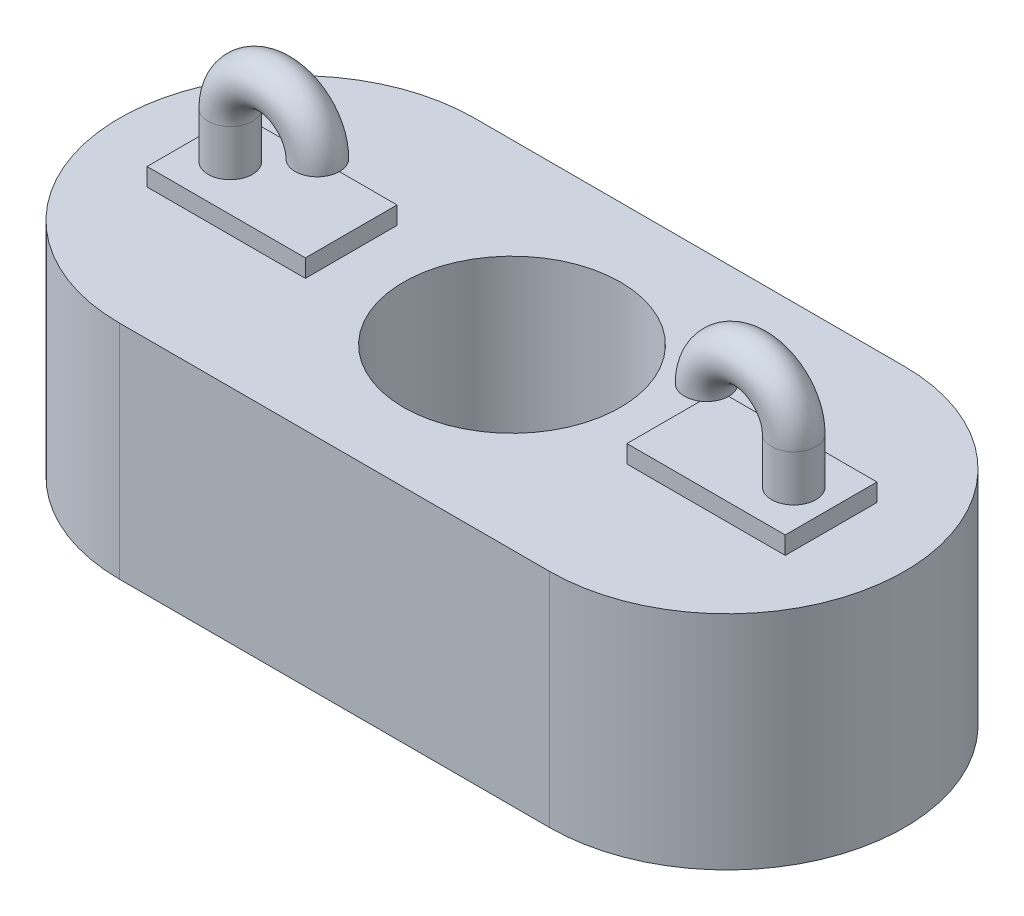
ISO-10303-21;
HEADER;
FILE_DESCRIPTION(('STEP AP214'),'2;1');
FILE_NAME('part.step','',(''),(''),'','','');
FILE_SCHEMA(('AUTOMOTIVE_DESIGN { 1 0 10303 214 1 1 1 1 }'));
ENDSEC;
DATA;
#1=APPLICATION_CONTEXT('core data for automotive mechanical design processes');
#2=APPLICATION_PROTOCOL_DEFINITION('international standard','automotive_design',2000,#1);
#3=PRODUCT_CONTEXT('',#1,'mechanical');
#4=PRODUCT('Part','Part','',(#3));
#5=PRODUCT_RELATED_PRODUCT_CATEGORY('part','',(#4));
#6=PRODUCT_DEFINITION_FORMATION('','',#4);
#7=PRODUCT_DEFINITION_CONTEXT('part definition',#1,'design');
#8=PRODUCT_DEFINITION('design','',#6,#7);
#9=PRODUCT_DEFINITION_SHAPE('','',#8);
#10=(LENGTH_UNIT() NAMED_UNIT(*) SI_UNIT(.MILLI.,.METRE.));
#11=(NAMED_UNIT(*) PLANE_ANGLE_UNIT() SI_UNIT($,.RADIAN.));
#12=(NAMED_UNIT(*) SI_UNIT($,.STERADIAN.) SOLID_ANGLE_UNIT());
#13=UNCERTAINTY_MEASURE_WITH_UNIT(LENGTH_MEASURE(1.E-05),#10,'distance_accuracy_value','');
#14=(GEOMETRIC_REPRESENTATION_CONTEXT(3) GLOBAL_UNCERTAINTY_ASSIGNED_CONTEXT((#13)) GLOBAL_UNIT_ASSIGNED_CONTEXT((#10,
#11,#12)) REPRESENTATION_CONTEXT('',''));
#15=CARTESIAN_POINT('',(0.,0.,0.));
#16=DIRECTION('',(0.,0.,1.));
#17=DIRECTION('',(1.,0.,0.));
#18=AXIS2_PLACEMENT_3D('',#15,#16,#17);
#19=CARTESIAN_POINT('',(4.8461150720265,5.,0.));
#20=DIRECTION('',(0.,-1.,0.));
#21=DIRECTION('',(0.,0.,-1.));
#22=AXIS2_PLACEMENT_3D('',#19,#20,#21);
#23=PLANE('',#22);
#24=DIRECTION('',(-1.,0.,0.));
#25=VECTOR('',#24,1.);
#26=CARTESIAN_POINT('',(7.19067537341715,5.,1.03330571310918));
#27=LINE('',#26,#25);
#28=CARTESIAN_POINT('',(7.19067537341715,5.,1.03330571310918));
#29=VERTEX_POINT('',#28);
#30=CARTESIAN_POINT('',(3.62364743227321,5.,1.03330571310918));
#31=VERTEX_POINT('',#30);
#32=EDGE_CURVE('E159',#29,#31,#27,.T.);
#33=ORIENTED_EDGE('',*,*,#32,.T.);
#34=DIRECTION('',(0.,0.,-1.));
#35=VECTOR('',#34,1.);
#36=CARTESIAN_POINT('',(3.62364743227321,5.,1.03330571310918));
#37=LINE('',#36,#35);
#38=CARTESIAN_POINT('',(3.62364743227321,5.,-1.03330571310918));
#39=VERTEX_POINT('',#38);
#40=EDGE_CURVE('E155',#31,#39,#37,.T.);
#41=ORIENTED_EDGE('',*,*,#40,.T.);
#42=DIRECTION('',(1.,0.,0.));
#43=VECTOR('',#42,1.);
#44=CARTESIAN_POINT('',(7.19067537341715,5.,-1.03330571310918));
#45=LINE('',#44,#43);
#46=CARTESIAN_POINT('',(7.19067537341715,5.,-1.03330571310918));
#47=VERTEX_POINT('',#46);
#48=EDGE_CURVE('E168',#39,#47,#45,.T.);
#49=ORIENTED_EDGE('',*,*,#48,.T.);
#50=DIRECTION('',(0.,0.,1.));
#51=VECTOR('',#50,1.);
#52=CARTESIAN_POINT('',(7.19067537341715,5.,1.03330571310918));
#53=LINE('',#52,#51);
#54=EDGE_CURVE('E72',#47,#29,#53,.T.);
#55=ORIENTED_EDGE('',*,*,#54,.T.);
#56=EDGE_LOOP('',(#33,#41,#49,#55));
#57=FACE_BOUND('',#56,.T.);
#58=CARTESIAN_POINT('',(0.,5.,0.));
#59=DIRECTION('',(0.,1.,0.));
#60=DIRECTION('',(0.,0.,1.));
#61=AXIS2_PLACEMENT_3D('',#58,#59,#60);
#62=CIRCLE('',#61,2.44543136988168);
#63=CARTESIAN_POINT('',(0.,5.,2.44543136988168));
#64=VERTEX_POINT('',#63);
#65=EDGE_CURVE('E226',#64,#64,#62,.T.);
#66=ORIENTED_EDGE('',*,*,#65,.F.);
#67=EDGE_LOOP('',(#66));
#68=FACE_BOUND('',#67,.T.);
#69=CARTESIAN_POINT('',(4.8461150720265,5.,0.));
#70=DIRECTION('',(0.,1.,0.));
#71=DIRECTION('',(0.,0.,-1.));
#72=AXIS2_PLACEMENT_3D('',#69,#70,#71);
#73=CIRCLE('',#72,4.);
#74=CARTESIAN_POINT('',(4.8461150720265,5.,4.));
#75=VERTEX_POINT('',#74);
#76=CARTESIAN_POINT('',(4.8461150720265,5.,-4.));
#77=VERTEX_POINT('',#76);
#78=EDGE_CURVE('E232',#75,#77,#73,.T.);
#79=ORIENTED_EDGE('',*,*,#78,.T.);
#80=DIRECTION('',(-1.,0.,0.));
#81=VECTOR('',#80,1.);
#82=CARTESIAN_POINT('',(-4.8461150720265,5.,-4.));
#83=LINE('',#82,#81);
#84=CARTESIAN_POINT('',(-4.8461150720265,5.,-4.));
#85=VERTEX_POINT('',#84);
#86=EDGE_CURVE('E235',#77,#85,#83,.T.);
#87=ORIENTED_EDGE('',*,*,#86,.T.);
#88=CARTESIAN_POINT('',(-4.8461150720265,5.,0.));
#89=DIRECTION('',(0.,1.,0.));
#90=DIRECTION('',(0.,0.,1.));
#91=AXIS2_PLACEMENT_3D('',#88,#89,#90);
#92=CIRCLE('',#91,4.);
#93=CARTESIAN_POINT('',(-4.8461150720265,5.,4.));
#94=VERTEX_POINT('',#93);
#95=EDGE_CURVE('E238',#85,#94,#92,.T.);
#96=ORIENTED_EDGE('',*,*,#95,.T.);
#97=DIRECTION('',(1.,0.,0.));
#98=VECTOR('',#97,1.);
#99=CARTESIAN_POINT('',(-4.8461150720265,5.,4.));
#100=LINE('',#99,#98);
#101=EDGE_CURVE('E240',#94,#75,#100,.T.);
#102=ORIENTED_EDGE('',*,*,#101,.T.);
#103=EDGE_LOOP('',(#79,#87,#96,#102));
#104=FACE_BOUND('',#103,.T.);
#105=DIRECTION('',(0.,0.,-1.));
#106=VECTOR('',#105,1.);
#107=CARTESIAN_POINT('',(-3.62364743227321,5.,1.03330571310918));
#108=LINE('',#107,#106);
#109=CARTESIAN_POINT('',(-3.62364743227321,5.,1.03330571310918));
#110=VERTEX_POINT('',#109);
#111=CARTESIAN_POINT('',(-3.62364743227321,5.,-1.03330571310918));
#112=VERTEX_POINT('',#111);
#113=EDGE_CURVE('E195',#110,#112,#108,.T.);
#114=ORIENTED_EDGE('',*,*,#113,.F.);
#115=DIRECTION('',(1.,0.,0.));
#116=VECTOR('',#115,1.);
#117=CARTESIAN_POINT('',(-7.19067537341715,5.,1.03330571310918));
#118=LINE('',#117,#116);
#119=CARTESIAN_POINT('',(-7.19067537341715,5.,1.03330571310918));
#120=VERTEX_POINT('',#119);
#121=EDGE_CURVE('E200',#120,#110,#118,.T.);
#122=ORIENTED_EDGE('',*,*,#121,.F.);
#123=DIRECTION('',(0.,0.,1.));
#124=VECTOR('',#123,1.);
#125=CARTESIAN_POINT('',(-7.19067537341715,5.,1.03330571310918));
#126=LINE('',#125,#124);
#127=CARTESIAN_POINT('',(-7.19067537341715,5.,-1.03330571310918));
#128=VERTEX_POINT('',#127);
#129=EDGE_CURVE('E210',#128,#120,#126,.T.);
#130=ORIENTED_EDGE('',*,*,#129,.F.);
#131=DIRECTION('',(-1.,0.,0.));
#132=VECTOR('',#131,1.);
#133=CARTESIAN_POINT('',(-7.19067537341715,5.,-1.03330571310918));
#134=LINE('',#133,#132);
#135=EDGE_CURVE('E80',#112,#128,#134,.T.);
#136=ORIENTED_EDGE('',*,*,#135,.F.);
#137=EDGE_LOOP('',(#114,#122,#130,#136));
#138=FACE_BOUND('',#137,.T.);
#139=ADVANCED_FACE('F57',(#57,#68,#104,#138),#23,.F.);
#140=CARTESIAN_POINT('',(4.8461150720265,0.,0.));
#141=DIRECTION('',(0.,-1.,0.));
#142=DIRECTION('',(0.,0.,-1.));
#143=AXIS2_PLACEMENT_3D('',#140,#141,#142);
#144=PLANE('',#143);
#145=CARTESIAN_POINT('',(4.8461150720265,0.,0.));
#146=DIRECTION('',(0.,1.,0.));
#147=DIRECTION('',(0.,0.,-1.));
#148=AXIS2_PLACEMENT_3D('',#145,#146,#147);
#149=CIRCLE('',#148,4.);
#150=CARTESIAN_POINT('',(4.8461150720265,0.,4.));
#151=VERTEX_POINT('',#150);
#152=CARTESIAN_POINT('',(4.8461150720265,0.,-4.));
#153=VERTEX_POINT('',#152);
#154=EDGE_CURVE('E229',#151,#153,#149,.T.);
#155=ORIENTED_EDGE('',*,*,#154,.F.);
#156=DIRECTION('',(1.,0.,0.));
#157=VECTOR('',#156,1.);
#158=CARTESIAN_POINT('',(-4.8461150720265,0.,4.));
#159=LINE('',#158,#157);
#160=CARTESIAN_POINT('',(-4.8461150720265,0.,4.));
#161=VERTEX_POINT('',#160);
#162=EDGE_CURVE('E236',#161,#151,#159,.T.);
#163=ORIENTED_EDGE('',*,*,#162,.F.);
#164=CARTESIAN_POINT('',(-4.8461150720265,0.,0.));
#165=DIRECTION('',(0.,1.,0.));
#166=DIRECTION('',(0.,0.,1.));
#167=AXIS2_PLACEMENT_3D('',#164,#165,#166);
#168=CIRCLE('',#167,4.);
#169=CARTESIAN_POINT('',(-4.8461150720265,0.,-4.));
#170=VERTEX_POINT('',#169);
#171=EDGE_CURVE('E247',#170,#161,#168,.T.);
#172=ORIENTED_EDGE('',*,*,#171,.F.);
#173=DIRECTION('',(-1.,0.,0.));
#174=VECTOR('',#173,1.);
#175=CARTESIAN_POINT('',(-4.8461150720265,0.,-4.));
#176=LINE('',#175,#174);
#177=EDGE_CURVE('E245',#153,#170,#176,.T.);
#178=ORIENTED_EDGE('',*,*,#177,.F.);
#179=EDGE_LOOP('',(#155,#163,#172,#178));
#180=FACE_BOUND('',#179,.T.);
#181=CARTESIAN_POINT('',(0.,0.,0.));
#182=DIRECTION('',(0.,1.,0.));
#183=DIRECTION('',(0.,0.,1.));
#184=AXIS2_PLACEMENT_3D('',#181,#182,#183);
#185=CIRCLE('',#184,2.44543136988168);
#186=CARTESIAN_POINT('',(0.,0.,2.44543136988168));
#187=VERTEX_POINT('',#186);
#188=EDGE_CURVE('E225',#187,#187,#185,.T.);
#189=ORIENTED_EDGE('',*,*,#188,.T.);
#190=EDGE_LOOP('',(#189));
#191=FACE_BOUND('',#190,.T.);
#192=ADVANCED_FACE('F287',(#180,#191),#144,.T.);
#193=CARTESIAN_POINT('',(4.8461150720265,5.,0.));
#194=DIRECTION('',(0.,-1.,0.));
#195=DIRECTION('',(0.,0.,-1.));
#196=AXIS2_PLACEMENT_3D('',#193,#194,#195);
#197=CYLINDRICAL_SURFACE('',#196,4.);
#198=ORIENTED_EDGE('',*,*,#154,.T.);
#199=DIRECTION('',(0.,-1.,0.));
#200=VECTOR('',#199,1.);
#201=CARTESIAN_POINT('',(4.8461150720265,5.,-4.));
#202=LINE('',#201,#200);
#203=EDGE_CURVE('E258',#77,#153,#202,.T.);
#204=ORIENTED_EDGE('',*,*,#203,.F.);
#205=ORIENTED_EDGE('',*,*,#78,.F.);
#206=DIRECTION('',(0.,-1.,0.));
#207=VECTOR('',#206,1.);
#208=CARTESIAN_POINT('',(4.8461150720265,5.,4.));
#209=LINE('',#208,#207);
#210=EDGE_CURVE('E242',#75,#151,#209,.T.);
#211=ORIENTED_EDGE('',*,*,#210,.T.);
#212=EDGE_LOOP('',(#198,#204,#205,#211));
#213=FACE_BOUND('',#212,.T.);
#214=ADVANCED_FACE('F59',(#213),#197,.T.);
#215=CARTESIAN_POINT('',(-4.8461150720265,5.,-4.));
#216=DIRECTION('',(0.,0.,1.));
#217=DIRECTION('',(1.,0.,0.));
#218=AXIS2_PLACEMENT_3D('',#215,#216,#217);
#219=PLANE('',#218);
#220=ORIENTED_EDGE('',*,*,#177,.T.);
#221=DIRECTION('',(0.,-1.,0.));
#222=VECTOR('',#221,1.);
#223=CARTESIAN_POINT('',(-4.8461150720265,5.,-4.));
#224=LINE('',#223,#222);
#225=EDGE_CURVE('E255',#85,#170,#224,.T.);
#226=ORIENTED_EDGE('',*,*,#225,.F.);
#227=ORIENTED_EDGE('',*,*,#86,.F.);
#228=ORIENTED_EDGE('',*,*,#203,.T.);
#229=EDGE_LOOP('',(#220,#226,#227,#228));
#230=FACE_BOUND('',#229,.T.);
#231=ADVANCED_FACE('F306',(#230),#219,.F.);
#232=CARTESIAN_POINT('',(-4.8461150720265,5.,0.));
#233=DIRECTION('',(0.,-1.,0.));
#234=DIRECTION('',(0.,0.,-1.));
#235=AXIS2_PLACEMENT_3D('',#232,#233,#234);
#236=CYLINDRICAL_SURFACE('',#235,4.);
#237=ORIENTED_EDGE('',*,*,#171,.T.);
#238=DIRECTION('',(0.,-1.,0.));
#239=VECTOR('',#238,1.);
#240=CARTESIAN_POINT('',(-4.8461150720265,5.,4.));
#241=LINE('',#240,#239);
#242=EDGE_CURVE('E252',#94,#161,#241,.T.);
#243=ORIENTED_EDGE('',*,*,#242,.F.);
#244=ORIENTED_EDGE('',*,*,#95,.F.);
#245=ORIENTED_EDGE('',*,*,#225,.T.);
#246=EDGE_LOOP('',(#237,#243,#244,#245));
#247=FACE_BOUND('',#246,.T.);
#248=ADVANCED_FACE('F303',(#247),#236,.T.);
#249=CARTESIAN_POINT('',(-4.8461150720265,5.,4.));
#250=DIRECTION('',(0.,0.,-1.));
#251=DIRECTION('',(-1.,0.,0.));
#252=AXIS2_PLACEMENT_3D('',#249,#250,#251);
#253=PLANE('',#252);
#254=ORIENTED_EDGE('',*,*,#162,.T.);
#255=ORIENTED_EDGE('',*,*,#210,.F.);
#256=ORIENTED_EDGE('',*,*,#101,.F.);
#257=ORIENTED_EDGE('',*,*,#242,.T.);
#258=EDGE_LOOP('',(#254,#255,#256,#257));
#259=FACE_BOUND('',#258,.T.);
#260=ADVANCED_FACE('F300',(#259),#253,.F.);
#261=CARTESIAN_POINT('',(0.,5.,0.));
#262=DIRECTION('',(0.,-1.,0.));
#263=DIRECTION('',(0.,0.,-1.));
#264=AXIS2_PLACEMENT_3D('',#261,#262,#263);
#265=CYLINDRICAL_SURFACE('',#264,2.44543136988168);
#266=ORIENTED_EDGE('',*,*,#65,.T.);
#267=EDGE_LOOP('',(#266));
#268=FACE_BOUND('',#267,.T.);
#269=ORIENTED_EDGE('',*,*,#188,.F.);
#270=EDGE_LOOP('',(#269));
#271=FACE_BOUND('',#270,.T.);
#272=ADVANCED_FACE('F297',(#268,#271),#265,.F.);
#273=CARTESIAN_POINT('',(-3.62364743227321,5.4,1.03330571310918));
#274=DIRECTION('',(-1.,0.,0.));
#275=DIRECTION('',(0.,0.,1.));
#276=AXIS2_PLACEMENT_3D('',#273,#274,#275);
#277=PLANE('',#276);
#278=ORIENTED_EDGE('',*,*,#113,.T.);
#279=DIRECTION('',(0.,-1.,0.));
#280=VECTOR('',#279,1.);
#281=CARTESIAN_POINT('',(-3.62364743227321,5.4,-1.03330571310918));
#282=LINE('',#281,#280);
#283=CARTESIAN_POINT('',(-3.62364743227321,5.4,-1.03330571310918));
#284=VERTEX_POINT('',#283);
#285=EDGE_CURVE('E223',#284,#112,#282,.T.);
#286=ORIENTED_EDGE('',*,*,#285,.F.);
#287=DIRECTION('',(0.,0.,-1.));
#288=VECTOR('',#287,1.);
#289=CARTESIAN_POINT('',(-3.62364743227321,5.4,1.03330571310918));
#290=LINE('',#289,#288);
#291=CARTESIAN_POINT('',(-3.62364743227321,5.4,1.03330571310918));
#292=VERTEX_POINT('',#291);
#293=EDGE_CURVE('E196',#292,#284,#290,.T.);
#294=ORIENTED_EDGE('',*,*,#293,.F.);
#295=DIRECTION('',(0.,-1.,0.));
#296=VECTOR('',#295,1.);
#297=CARTESIAN_POINT('',(-3.62364743227321,5.4,1.03330571310918));
#298=LINE('',#297,#296);
#299=EDGE_CURVE('E206',#292,#110,#298,.T.);
#300=ORIENTED_EDGE('',*,*,#299,.T.);
#301=EDGE_LOOP('',(#278,#286,#294,#300));
#302=FACE_BOUND('',#301,.T.);
#303=ADVANCED_FACE('F278',(#302),#277,.F.);
#304=CARTESIAN_POINT('',(-7.19067537341715,5.4,-1.03330571310918));
#305=DIRECTION('',(0.,0.,1.));
#306=DIRECTION('',(1.,0.,0.));
#307=AXIS2_PLACEMENT_3D('',#304,#305,#306);
#308=PLANE('',#307);
#309=ORIENTED_EDGE('',*,*,#135,.T.);
#310=DIRECTION('',(0.,-1.,0.));
#311=VECTOR('',#310,1.);
#312=CARTESIAN_POINT('',(-7.19067537341715,5.4,-1.03330571310918));
#313=LINE('',#312,#311);
#314=CARTESIAN_POINT('',(-7.19067537341715,5.4,-1.03330571310918));
#315=VERTEX_POINT('',#314);
#316=EDGE_CURVE('E220',#315,#128,#313,.T.);
#317=ORIENTED_EDGE('',*,*,#316,.F.);
#318=DIRECTION('',(-1.,0.,0.));
#319=VECTOR('',#318,1.);
#320=CARTESIAN_POINT('',(-7.19067537341715,5.4,-1.03330571310918));
#321=LINE('',#320,#319);
#322=EDGE_CURVE('E199',#284,#315,#321,.T.);
#323=ORIENTED_EDGE('',*,*,#322,.F.);
#324=ORIENTED_EDGE('',*,*,#285,.T.);
#325=EDGE_LOOP('',(#309,#317,#323,#324));
#326=FACE_BOUND('',#325,.T.);
#327=ADVANCED_FACE('F280',(#326),#308,.F.);
#328=CARTESIAN_POINT('',(-7.19067537341715,5.4,1.03330571310918));
#329=DIRECTION('',(1.,0.,0.));
#330=DIRECTION('',(0.,0.,-1.));
#331=AXIS2_PLACEMENT_3D('',#328,#329,#330);
#332=PLANE('',#331);
#333=ORIENTED_EDGE('',*,*,#129,.T.);
#334=DIRECTION('',(0.,-1.,0.));
#335=VECTOR('',#334,1.);
#336=CARTESIAN_POINT('',(-7.19067537341715,5.4,1.03330571310918));
#337=LINE('',#336,#335);
#338=CARTESIAN_POINT('',(-7.19067537341715,5.4,1.03330571310918));
#339=VERTEX_POINT('',#338);
#340=EDGE_CURVE('E217',#339,#120,#337,.T.);
#341=ORIENTED_EDGE('',*,*,#340,.F.);
#342=DIRECTION('',(0.,0.,1.));
#343=VECTOR('',#342,1.);
#344=CARTESIAN_POINT('',(-7.19067537341715,5.4,1.03330571310918));
#345=LINE('',#344,#343);
#346=EDGE_CURVE('E202',#315,#339,#345,.T.);
#347=ORIENTED_EDGE('',*,*,#346,.F.);
#348=ORIENTED_EDGE('',*,*,#316,.T.);
#349=EDGE_LOOP('',(#333,#341,#347,#348));
#350=FACE_BOUND('',#349,.T.);
#351=ADVANCED_FACE('F284',(#350),#332,.F.);
#352=CARTESIAN_POINT('',(-7.19067537341715,5.4,1.03330571310918));
#353=DIRECTION('',(0.,0.,-1.));
#354=DIRECTION('',(-1.,0.,0.));
#355=AXIS2_PLACEMENT_3D('',#352,#353,#354);
#356=PLANE('',#355);
#357=ORIENTED_EDGE('',*,*,#121,.T.);
#358=ORIENTED_EDGE('',*,*,#299,.F.);
#359=DIRECTION('',(1.,0.,0.));
#360=VECTOR('',#359,1.);
#361=CARTESIAN_POINT('',(-7.19067537341715,5.4,1.03330571310918));
#362=LINE('',#361,#360);
#363=EDGE_CURVE('E204',#339,#292,#362,.T.);
#364=ORIENTED_EDGE('',*,*,#363,.F.);
#365=ORIENTED_EDGE('',*,*,#340,.T.);
#366=EDGE_LOOP('',(#357,#358,#364,#365));
#367=FACE_BOUND('',#366,.T.);
#368=ADVANCED_FACE('F269',(#367),#356,.F.);
#369=CARTESIAN_POINT('',(0.,5.4,0.));
#370=DIRECTION('',(0.,-1.,0.));
#371=DIRECTION('',(0.,0.,-1.));
#372=AXIS2_PLACEMENT_3D('',#369,#370,#371);
#373=PLANE('',#372);
#374=CARTESIAN_POINT('',(-6.34863907967939,5.4,0.));
#375=DIRECTION('',(0.,-1.,0.));
#376=DIRECTION('',(0.,0.,-1.));
#377=AXIS2_PLACEMENT_3D('',#374,#375,#376);
#378=CIRCLE('',#377,0.5);
#379=CARTESIAN_POINT('',(-6.34863907967939,5.4,-0.5));
#380=VERTEX_POINT('',#379);
#381=EDGE_CURVE('E65',#380,#380,#378,.F.);
#382=ORIENTED_EDGE('',*,*,#381,.F.);
#383=EDGE_LOOP('',(#382));
#384=FACE_BOUND('',#383,.T.);
#385=ORIENTED_EDGE('',*,*,#293,.T.);
#386=ORIENTED_EDGE('',*,*,#322,.T.);
#387=ORIENTED_EDGE('',*,*,#346,.T.);
#388=ORIENTED_EDGE('',*,*,#363,.T.);
#389=EDGE_LOOP('',(#385,#386,#387,#388));
#390=FACE_BOUND('',#389,.T.);
#391=ADVANCED_FACE('F265',(#384,#390),#373,.F.);
#392=CARTESIAN_POINT('',(-4.3860060843307,6.43701734776864,0.));
#393=DIRECTION('',(0.,1.,0.));
#394=DIRECTION('',(0.,0.,1.));
#395=AXIS2_PLACEMENT_3D('',#392,#393,#394);
#396=PLANE('',#395);
#397=CARTESIAN_POINT('',(-4.3860060843307,6.43701734776864,0.));
#398=DIRECTION('',(0.,1.,0.));
#399=DIRECTION('',(0.,0.,1.));
#400=AXIS2_PLACEMENT_3D('',#397,#398,#399);
#401=CIRCLE('',#400,0.5);
#402=CARTESIAN_POINT('',(-4.3860060843307,6.43701734776864,0.5));
#403=VERTEX_POINT('',#402);
#404=EDGE_CURVE('E193',#403,#403,#401,.T.);
#405=ORIENTED_EDGE('',*,*,#404,.F.);
#406=EDGE_LOOP('',(#405));
#407=FACE_BOUND('',#406,.T.);
#408=ADVANCED_FACE('F268',(#407),#396,.F.);
#409=CARTESIAN_POINT('',(-6.34863907967939,5.4,0.));
#410=DIRECTION('',(0.,1.,0.));
#411=DIRECTION('',(0.,0.,1.));
#412=AXIS2_PLACEMENT_3D('',#409,#410,#411);
#413=CYLINDRICAL_SURFACE('',#412,0.5);
#414=CARTESIAN_POINT('',(-6.34863907967939,6.43701734776864,0.));
#415=DIRECTION('',(0.,-1.,0.));
#416=DIRECTION('',(0.,0.,1.));
#417=AXIS2_PLACEMENT_3D('',#414,#415,#416);
#418=CIRCLE('',#417,0.5);
#419=CARTESIAN_POINT('',(-6.34863907967939,6.43701734776864,0.5));
#420=VERTEX_POINT('',#419);
#421=EDGE_CURVE('E190',#420,#420,#418,.T.);
#422=ORIENTED_EDGE('',*,*,#421,.T.);
#423=EDGE_LOOP('',(#422));
#424=FACE_BOUND('',#423,.T.);
#425=ORIENTED_EDGE('',*,*,#381,.T.);
#426=EDGE_LOOP('',(#425));
#427=FACE_BOUND('',#426,.T.);
#428=ADVANCED_FACE('F263',(#424,#427),#413,.T.);
#429=CARTESIAN_POINT('',(-5.36732258200504,6.43701734776864,0.));
#430=DIRECTION('',(0.,0.,-1.));
#431=DIRECTION('',(-1.,0.,0.));
#432=AXIS2_PLACEMENT_3D('',#429,#430,#431);
#433=TOROIDAL_SURFACE('',#432,0.98131649767434,0.5);
#434=ORIENTED_EDGE('',*,*,#404,.T.);
#435=EDGE_LOOP('',(#434));
#436=FACE_BOUND('',#435,.T.);
#437=ORIENTED_EDGE('',*,*,#421,.F.);
#438=EDGE_LOOP('',(#437));
#439=FACE_BOUND('',#438,.T.);
#440=ADVANCED_FACE('F271',(#436,#439),#433,.T.);
#441=CARTESIAN_POINT('',(3.62364743227321,5.4,1.03330571310918));
#442=DIRECTION('',(-1.,0.,0.));
#443=DIRECTION('',(0.,0.,1.));
#444=AXIS2_PLACEMENT_3D('',#441,#442,#443);
#445=PLANE('',#444);
#446=ORIENTED_EDGE('',*,*,#40,.F.);
#447=DIRECTION('',(0.,-1.,0.));
#448=VECTOR('',#447,1.);
#449=CARTESIAN_POINT('',(3.62364743227321,5.4,1.03330571310918));
#450=LINE('',#449,#448);
#451=CARTESIAN_POINT('',(3.62364743227321,5.4,1.03330571310918));
#452=VERTEX_POINT('',#451);
#453=EDGE_CURVE('E188',#452,#31,#450,.T.);
#454=ORIENTED_EDGE('',*,*,#453,.F.);
#455=DIRECTION('',(0.,0.,-1.));
#456=VECTOR('',#455,1.);
#457=CARTESIAN_POINT('',(3.62364743227321,5.4,1.03330571310918));
#458=LINE('',#457,#456);
#459=CARTESIAN_POINT('',(3.62364743227321,5.4,-1.03330571310918));
#460=VERTEX_POINT('',#459);
#461=EDGE_CURVE('E164',#452,#460,#458,.T.);
#462=ORIENTED_EDGE('',*,*,#461,.T.);
#463=DIRECTION('',(0.,-1.,0.));
#464=VECTOR('',#463,1.);
#465=CARTESIAN_POINT('',(3.62364743227321,5.4,-1.03330571310918));
#466=LINE('',#465,#464);
#467=EDGE_CURVE('E176',#460,#39,#466,.T.);
#468=ORIENTED_EDGE('',*,*,#467,.T.);
#469=EDGE_LOOP('',(#446,#454,#462,#468));
#470=FACE_BOUND('',#469,.T.);
#471=ADVANCED_FACE('F346',(#470),#445,.T.);
#472=CARTESIAN_POINT('',(7.19067537341715,5.4,1.03330571310918));
#473=DIRECTION('',(0.,0.,1.));
#474=DIRECTION('',(1.,0.,0.));
#475=AXIS2_PLACEMENT_3D('',#472,#473,#474);
#476=PLANE('',#475);
#477=ORIENTED_EDGE('',*,*,#32,.F.);
#478=DIRECTION('',(0.,-1.,0.));
#479=VECTOR('',#478,1.);
#480=CARTESIAN_POINT('',(7.19067537341715,5.4,1.03330571310918));
#481=LINE('',#480,#479);
#482=CARTESIAN_POINT('',(7.19067537341715,5.4,1.03330571310918));
#483=VERTEX_POINT('',#482);
#484=EDGE_CURVE('E186',#483,#29,#481,.T.);
#485=ORIENTED_EDGE('',*,*,#484,.F.);
#486=DIRECTION('',(-1.,0.,0.));
#487=VECTOR('',#486,1.);
#488=CARTESIAN_POINT('',(7.19067537341715,5.4,1.03330571310918));
#489=LINE('',#488,#487);
#490=EDGE_CURVE('E167',#483,#452,#489,.T.);
#491=ORIENTED_EDGE('',*,*,#490,.T.);
#492=ORIENTED_EDGE('',*,*,#453,.T.);
#493=EDGE_LOOP('',(#477,#485,#491,#492));
#494=FACE_BOUND('',#493,.T.);
#495=ADVANCED_FACE('F355',(#494),#476,.T.);
#496=CARTESIAN_POINT('',(7.19067537341715,5.4,1.03330571310918));
#497=DIRECTION('',(1.,0.,0.));
#498=DIRECTION('',(0.,0.,-1.));
#499=AXIS2_PLACEMENT_3D('',#496,#497,#498);
#500=PLANE('',#499);
#501=ORIENTED_EDGE('',*,*,#54,.F.);
#502=DIRECTION('',(0.,-1.,0.));
#503=VECTOR('',#502,1.);
#504=CARTESIAN_POINT('',(7.19067537341715,5.4,-1.03330571310918));
#505=LINE('',#504,#503);
#506=CARTESIAN_POINT('',(7.19067537341715,5.4,-1.03330571310918));
#507=VERTEX_POINT('',#506);
#508=EDGE_CURVE('E184',#507,#47,#505,.T.);
#509=ORIENTED_EDGE('',*,*,#508,.F.);
#510=DIRECTION('',(0.,0.,1.));
#511=VECTOR('',#510,1.);
#512=CARTESIAN_POINT('',(7.19067537341715,5.4,1.03330571310918));
#513=LINE('',#512,#511);
#514=EDGE_CURVE('E171',#507,#483,#513,.T.);
#515=ORIENTED_EDGE('',*,*,#514,.T.);
#516=ORIENTED_EDGE('',*,*,#484,.T.);
#517=EDGE_LOOP('',(#501,#509,#515,#516));
#518=FACE_BOUND('',#517,.T.);
#519=ADVANCED_FACE('F359',(#518),#500,.T.);
#520=CARTESIAN_POINT('',(7.19067537341715,5.4,-1.03330571310918));
#521=DIRECTION('',(0.,0.,-1.));
#522=DIRECTION('',(-1.,0.,0.));
#523=AXIS2_PLACEMENT_3D('',#520,#521,#522);
#524=PLANE('',#523);
#525=ORIENTED_EDGE('',*,*,#48,.F.);
#526=ORIENTED_EDGE('',*,*,#467,.F.);
#527=DIRECTION('',(1.,0.,0.));
#528=VECTOR('',#527,1.);
#529=CARTESIAN_POINT('',(7.19067537341715,5.4,-1.03330571310918));
#530=LINE('',#529,#528);
#531=EDGE_CURVE('E174',#460,#507,#530,.T.);
#532=ORIENTED_EDGE('',*,*,#531,.T.);
#533=ORIENTED_EDGE('',*,*,#508,.T.);
#534=EDGE_LOOP('',(#525,#526,#532,#533));
#535=FACE_BOUND('',#534,.T.);
#536=ADVANCED_FACE('F363',(#535),#524,.T.);
#537=CARTESIAN_POINT('',(0.,5.4,0.));
#538=DIRECTION('',(0.,-1.,0.));
#539=DIRECTION('',(0.,0.,-1.));
#540=AXIS2_PLACEMENT_3D('',#537,#538,#539);
#541=PLANE('',#540);
#542=CARTESIAN_POINT('',(6.34863907967939,5.4,0.));
#543=DIRECTION('',(0.,-1.,0.));
#544=DIRECTION('',(0.,0.,-1.));
#545=AXIS2_PLACEMENT_3D('',#542,#543,#544);
#546=CIRCLE('',#545,0.5);
#547=CARTESIAN_POINT('',(6.34863907967939,5.4,-0.5));
#548=VERTEX_POINT('',#547);
#549=EDGE_CURVE('E12',#548,#548,#546,.F.);
#550=ORIENTED_EDGE('',*,*,#549,.F.);
#551=EDGE_LOOP('',(#550));
#552=FACE_BOUND('',#551,.T.);
#553=ORIENTED_EDGE('',*,*,#461,.F.);
#554=ORIENTED_EDGE('',*,*,#490,.F.);
#555=ORIENTED_EDGE('',*,*,#514,.F.);
#556=ORIENTED_EDGE('',*,*,#531,.F.);
#557=EDGE_LOOP('',(#553,#554,#555,#556));
#558=FACE_BOUND('',#557,.T.);
#559=ADVANCED_FACE('F366',(#552,#558),#541,.F.);
#560=CARTESIAN_POINT('',(4.3860060843307,6.43701734776864,0.));
#561=DIRECTION('',(0.,1.,0.));
#562=DIRECTION('',(0.,0.,1.));
#563=AXIS2_PLACEMENT_3D('',#560,#561,#562);
#564=PLANE('',#563);
#565=CARTESIAN_POINT('',(4.3860060843307,6.43701734776864,0.));
#566=DIRECTION('',(0.,-1.,0.));
#567=DIRECTION('',(0.,0.,1.));
#568=AXIS2_PLACEMENT_3D('',#565,#566,#567);
#569=CIRCLE('',#568,0.5);
#570=CARTESIAN_POINT('',(4.3860060843307,6.43701734776864,0.5));
#571=VERTEX_POINT('',#570);
#572=EDGE_CURVE('E151',#571,#571,#569,.F.);
#573=ORIENTED_EDGE('',*,*,#572,.F.);
#574=EDGE_LOOP('',(#573));
#575=FACE_BOUND('',#574,.T.);
#576=ADVANCED_FACE('F370',(#575),#564,.F.);
#577=CARTESIAN_POINT('',(6.34863907967939,5.4,0.));
#578=DIRECTION('',(0.,1.,0.));
#579=DIRECTION('',(0.,0.,1.));
#580=AXIS2_PLACEMENT_3D('',#577,#578,#579);
#581=CYLINDRICAL_SURFACE('',#580,0.5);
#582=CARTESIAN_POINT('',(6.34863907967939,6.43701734776864,0.));
#583=DIRECTION('',(0.,1.,0.));
#584=DIRECTION('',(0.,0.,1.));
#585=AXIS2_PLACEMENT_3D('',#582,#583,#584);
#586=CIRCLE('',#585,0.5);
#587=CARTESIAN_POINT('',(6.34863907967939,6.43701734776864,0.5));
#588=VERTEX_POINT('',#587);
#589=EDGE_CURVE('E156',#588,#588,#586,.F.);
#590=ORIENTED_EDGE('',*,*,#589,.T.);
#591=EDGE_LOOP('',(#590));
#592=FACE_BOUND('',#591,.T.);
#593=ORIENTED_EDGE('',*,*,#549,.T.);
#594=EDGE_LOOP('',(#593));
#595=FACE_BOUND('',#594,.T.);
#596=ADVANCED_FACE('F374',(#592,#595),#581,.T.);
#597=CARTESIAN_POINT('',(5.36732258200504,6.43701734776864,0.));
#598=DIRECTION('',(0.,0.,1.));
#599=DIRECTION('',(1.,0.,0.));
#600=AXIS2_PLACEMENT_3D('',#597,#598,#599);
#601=TOROIDAL_SURFACE('',#600,0.98131649767434,0.5);
#602=ORIENTED_EDGE('',*,*,#572,.T.);
#603=EDGE_LOOP('',(#602));
#604=FACE_BOUND('',#603,.T.);
#605=ORIENTED_EDGE('',*,*,#589,.F.);
#606=EDGE_LOOP('',(#605));
#607=FACE_BOUND('',#606,.T.);
#608=ADVANCED_FACE('F152',(#604,#607),#601,.T.);
#609=CLOSED_SHELL('',(#139,#192,#214,#231,#248,#260,#272,#303,#327,#351,#368,#391,#408,#428,
#440,#471,#495,#519,#536,#559,#576,#596,#608));
#610=MANIFOLD_SOLID_BREP('B2',#609);
#611=ADVANCED_BREP_SHAPE_REPRESENTATION('',(#18,#610),#14);
#612=SHAPE_DEFINITION_REPRESENTATION(#9,#611);
ENDSEC;
END-ISO-10303-21;
